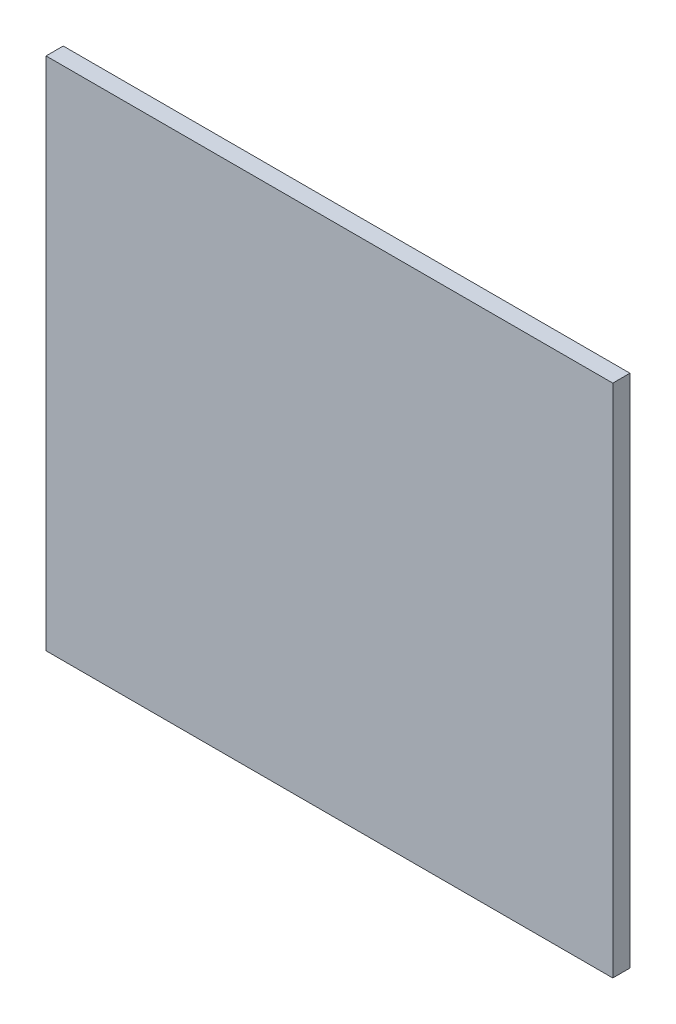
ISO-10303-21;
HEADER;
FILE_DESCRIPTION(('STEP AP214'),'2;1');
FILE_NAME('part.step','',(''),(''),'','','');
FILE_SCHEMA(('AUTOMOTIVE_DESIGN { 1 0 10303 214 1 1 1 1 }'));
ENDSEC;
DATA;
#1=APPLICATION_CONTEXT('core data for automotive mechanical design processes');
#2=APPLICATION_PROTOCOL_DEFINITION('international standard','automotive_design',2000,#1);
#3=PRODUCT_CONTEXT('',#1,'mechanical');
#4=PRODUCT('Part','Part','',(#3));
#5=PRODUCT_RELATED_PRODUCT_CATEGORY('part','',(#4));
#6=PRODUCT_DEFINITION_FORMATION('','',#4);
#7=PRODUCT_DEFINITION_CONTEXT('part definition',#1,'design');
#8=PRODUCT_DEFINITION('design','',#6,#7);
#9=PRODUCT_DEFINITION_SHAPE('','',#8);
#10=(LENGTH_UNIT() NAMED_UNIT(*) SI_UNIT(.MILLI.,.METRE.));
#11=(NAMED_UNIT(*) PLANE_ANGLE_UNIT() SI_UNIT($,.RADIAN.));
#12=(NAMED_UNIT(*) SI_UNIT($,.STERADIAN.) SOLID_ANGLE_UNIT());
#13=UNCERTAINTY_MEASURE_WITH_UNIT(LENGTH_MEASURE(1.E-05),#10,'distance_accuracy_value','');
#14=(GEOMETRIC_REPRESENTATION_CONTEXT(3) GLOBAL_UNCERTAINTY_ASSIGNED_CONTEXT((#13)) GLOBAL_UNIT_ASSIGNED_CONTEXT((#10,
#11,#12)) REPRESENTATION_CONTEXT('',''));
#15=CARTESIAN_POINT('',(0.,0.,0.));
#16=DIRECTION('',(0.,0.,1.));
#17=DIRECTION('',(1.,0.,0.));
#18=AXIS2_PLACEMENT_3D('',#15,#16,#17);
#19=CARTESIAN_POINT('',(-1.65,-1.5,0.1));
#20=DIRECTION('',(0.,0.,-1.));
#21=DIRECTION('',(-1.,0.,0.));
#22=AXIS2_PLACEMENT_3D('',#19,#20,#21);
#23=PLANE('',#22);
#24=DIRECTION('',(0.,1.,0.));
#25=VECTOR('',#24,1.);
#26=CARTESIAN_POINT('',(1.65,-1.5,0.1));
#27=LINE('',#26,#25);
#28=CARTESIAN_POINT('',(1.65,-1.5,0.1));
#29=VERTEX_POINT('',#28);
#30=CARTESIAN_POINT('',(1.65,1.5,0.1));
#31=VERTEX_POINT('',#30);
#32=EDGE_CURVE('E55',#29,#31,#27,.T.);
#33=ORIENTED_EDGE('',*,*,#32,.T.);
#34=DIRECTION('',(1.,0.,0.));
#35=VECTOR('',#34,1.);
#36=CARTESIAN_POINT('',(1.65,1.5,0.1));
#37=LINE('',#36,#35);
#38=CARTESIAN_POINT('',(-1.65,1.5,0.1));
#39=VERTEX_POINT('',#38);
#40=EDGE_CURVE('E57',#31,#39,#37,.F.);
#41=ORIENTED_EDGE('',*,*,#40,.T.);
#42=DIRECTION('',(0.,1.,0.));
#43=VECTOR('',#42,1.);
#44=CARTESIAN_POINT('',(-1.65,1.5,0.1));
#45=LINE('',#44,#43);
#46=CARTESIAN_POINT('',(-1.65,-1.5,0.1));
#47=VERTEX_POINT('',#46);
#48=EDGE_CURVE('E20',#39,#47,#45,.F.);
#49=ORIENTED_EDGE('',*,*,#48,.T.);
#50=DIRECTION('',(1.,0.,0.));
#51=VECTOR('',#50,1.);
#52=CARTESIAN_POINT('',(-1.65,-1.5,0.1));
#53=LINE('',#52,#51);
#54=EDGE_CURVE('E80',#47,#29,#53,.T.);
#55=ORIENTED_EDGE('',*,*,#54,.T.);
#56=EDGE_LOOP('',(#33,#41,#49,#55));
#57=FACE_BOUND('',#56,.T.);
#58=ADVANCED_FACE('F17',(#57),#23,.F.);
#59=CARTESIAN_POINT('',(-1.65,1.5,0.));
#60=DIRECTION('',(1.,0.,0.));
#61=DIRECTION('',(0.,0.,-1.));
#62=AXIS2_PLACEMENT_3D('',#59,#60,#61);
#63=PLANE('',#62);
#64=DIRECTION('',(0.,0.,1.));
#65=VECTOR('',#64,1.);
#66=CARTESIAN_POINT('',(-1.65,-1.5,0.));
#67=LINE('',#66,#65);
#68=CARTESIAN_POINT('',(-1.65,-1.5,0.));
#69=VERTEX_POINT('',#68);
#70=EDGE_CURVE('E68',#69,#47,#67,.T.);
#71=ORIENTED_EDGE('',*,*,#70,.T.);
#72=ORIENTED_EDGE('',*,*,#48,.F.);
#73=DIRECTION('',(0.,0.,-1.));
#74=VECTOR('',#73,1.);
#75=CARTESIAN_POINT('',(-1.65,1.5,0.));
#76=LINE('',#75,#74);
#77=CARTESIAN_POINT('',(-1.65,1.5,0.));
#78=VERTEX_POINT('',#77);
#79=EDGE_CURVE('E63',#39,#78,#76,.T.);
#80=ORIENTED_EDGE('',*,*,#79,.T.);
#81=DIRECTION('',(0.,1.,0.));
#82=VECTOR('',#81,1.);
#83=CARTESIAN_POINT('',(-1.65,-1.5,0.));
#84=LINE('',#83,#82);
#85=EDGE_CURVE('E83',#69,#78,#84,.T.);
#86=ORIENTED_EDGE('',*,*,#85,.F.);
#87=EDGE_LOOP('',(#71,#72,#80,#86));
#88=FACE_BOUND('',#87,.T.);
#89=ADVANCED_FACE('F65',(#88),#63,.F.);
#90=CARTESIAN_POINT('',(1.65,1.5,0.));
#91=DIRECTION('',(0.,-1.,0.));
#92=DIRECTION('',(0.,0.,-1.));
#93=AXIS2_PLACEMENT_3D('',#90,#91,#92);
#94=PLANE('',#93);
#95=ORIENTED_EDGE('',*,*,#79,.F.);
#96=ORIENTED_EDGE('',*,*,#40,.F.);
#97=DIRECTION('',(0.,0.,1.));
#98=VECTOR('',#97,1.);
#99=CARTESIAN_POINT('',(1.65,1.5,0.));
#100=LINE('',#99,#98);
#101=CARTESIAN_POINT('',(1.65,1.5,0.));
#102=VERTEX_POINT('',#101);
#103=EDGE_CURVE('E75',#31,#102,#100,.F.);
#104=ORIENTED_EDGE('',*,*,#103,.T.);
#105=DIRECTION('',(-1.,0.,0.));
#106=VECTOR('',#105,1.);
#107=CARTESIAN_POINT('',(-1.65,1.5,0.));
#108=LINE('',#107,#106);
#109=EDGE_CURVE('E72',#78,#102,#108,.F.);
#110=ORIENTED_EDGE('',*,*,#109,.F.);
#111=EDGE_LOOP('',(#95,#96,#104,#110));
#112=FACE_BOUND('',#111,.T.);
#113=ADVANCED_FACE('F70',(#112),#94,.F.);
#114=CARTESIAN_POINT('',(1.65,-1.5,0.));
#115=DIRECTION('',(-1.,0.,0.));
#116=DIRECTION('',(0.,0.,1.));
#117=AXIS2_PLACEMENT_3D('',#114,#115,#116);
#118=PLANE('',#117);
#119=ORIENTED_EDGE('',*,*,#103,.F.);
#120=ORIENTED_EDGE('',*,*,#32,.F.);
#121=DIRECTION('',(0.,0.,1.));
#122=VECTOR('',#121,1.);
#123=CARTESIAN_POINT('',(1.65,-1.5,0.));
#124=LINE('',#123,#122);
#125=CARTESIAN_POINT('',(1.65,-1.5,0.));
#126=VERTEX_POINT('',#125);
#127=EDGE_CURVE('E35',#29,#126,#124,.F.);
#128=ORIENTED_EDGE('',*,*,#127,.T.);
#129=DIRECTION('',(0.,1.,0.));
#130=VECTOR('',#129,1.);
#131=CARTESIAN_POINT('',(1.65,-1.5,0.));
#132=LINE('',#131,#130);
#133=EDGE_CURVE('E26',#102,#126,#132,.F.);
#134=ORIENTED_EDGE('',*,*,#133,.F.);
#135=EDGE_LOOP('',(#119,#120,#128,#134));
#136=FACE_BOUND('',#135,.T.);
#137=ADVANCED_FACE('F89',(#136),#118,.F.);
#138=CARTESIAN_POINT('',(-1.65,-1.5,0.));
#139=DIRECTION('',(0.,1.,0.));
#140=DIRECTION('',(0.,0.,1.));
#141=AXIS2_PLACEMENT_3D('',#138,#139,#140);
#142=PLANE('',#141);
#143=ORIENTED_EDGE('',*,*,#127,.F.);
#144=ORIENTED_EDGE('',*,*,#54,.F.);
#145=ORIENTED_EDGE('',*,*,#70,.F.);
#146=DIRECTION('',(-1.,0.,0.));
#147=VECTOR('',#146,1.);
#148=CARTESIAN_POINT('',(-1.65,-1.5,0.));
#149=LINE('',#148,#147);
#150=EDGE_CURVE('E11',#126,#69,#149,.T.);
#151=ORIENTED_EDGE('',*,*,#150,.F.);
#152=EDGE_LOOP('',(#143,#144,#145,#151));
#153=FACE_BOUND('',#152,.T.);
#154=ADVANCED_FACE('F91',(#153),#142,.F.);
#155=CARTESIAN_POINT('',(-1.65,-1.5,0.));
#156=DIRECTION('',(0.,0.,-1.));
#157=DIRECTION('',(-1.,0.,0.));
#158=AXIS2_PLACEMENT_3D('',#155,#156,#157);
#159=PLANE('',#158);
#160=ORIENTED_EDGE('',*,*,#133,.T.);
#161=ORIENTED_EDGE('',*,*,#150,.T.);
#162=ORIENTED_EDGE('',*,*,#85,.T.);
#163=ORIENTED_EDGE('',*,*,#109,.T.);
#164=EDGE_LOOP('',(#160,#161,#162,#163));
#165=FACE_BOUND('',#164,.T.);
#166=ADVANCED_FACE('F88',(#165),#159,.T.);
#167=CLOSED_SHELL('',(#58,#89,#113,#137,#154,#166));
#168=MANIFOLD_SOLID_BREP('B1',#167);
#169=ADVANCED_BREP_SHAPE_REPRESENTATION('',(#18,#168),#14);
#170=SHAPE_DEFINITION_REPRESENTATION(#9,#169);
ENDSEC;
END-ISO-10303-21;
